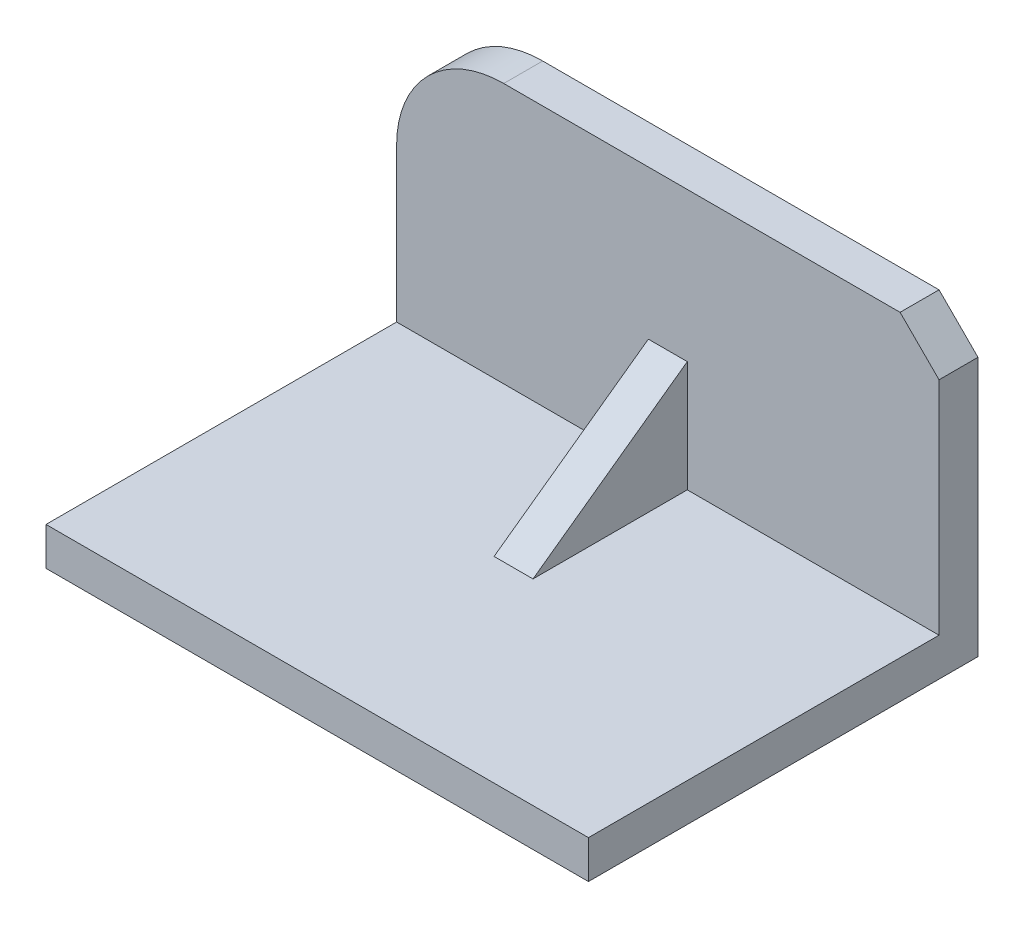
ISO-10303-21;
HEADER;
FILE_DESCRIPTION(('STEP AP214'),'2;1');
FILE_NAME('part.step','',(''),(''),'','','');
FILE_SCHEMA(('AUTOMOTIVE_DESIGN { 1 0 10303 214 1 1 1 1 }'));
ENDSEC;
DATA;
#1=APPLICATION_CONTEXT('core data for automotive mechanical design processes');
#2=APPLICATION_PROTOCOL_DEFINITION('international standard','automotive_design',2000,#1);
#3=PRODUCT_CONTEXT('',#1,'mechanical');
#4=PRODUCT('Part','Part','',(#3));
#5=PRODUCT_RELATED_PRODUCT_CATEGORY('part','',(#4));
#6=PRODUCT_DEFINITION_FORMATION('','',#4);
#7=PRODUCT_DEFINITION_CONTEXT('part definition',#1,'design');
#8=PRODUCT_DEFINITION('design','',#6,#7);
#9=PRODUCT_DEFINITION_SHAPE('','',#8);
#10=(LENGTH_UNIT() NAMED_UNIT(*) SI_UNIT(.MILLI.,.METRE.));
#11=(NAMED_UNIT(*) PLANE_ANGLE_UNIT() SI_UNIT($,.RADIAN.));
#12=(NAMED_UNIT(*) SI_UNIT($,.STERADIAN.) SOLID_ANGLE_UNIT());
#13=UNCERTAINTY_MEASURE_WITH_UNIT(LENGTH_MEASURE(1.E-05),#10,'distance_accuracy_value','');
#14=(GEOMETRIC_REPRESENTATION_CONTEXT(3) GLOBAL_UNCERTAINTY_ASSIGNED_CONTEXT((#13)) GLOBAL_UNIT_ASSIGNED_CONTEXT((#10,
#11,#12)) REPRESENTATION_CONTEXT('',''));
#15=CARTESIAN_POINT('',(0.,0.,0.));
#16=DIRECTION('',(0.,0.,1.));
#17=DIRECTION('',(1.,0.,0.));
#18=AXIS2_PLACEMENT_3D('',#15,#16,#17);
#19=CARTESIAN_POINT('',(69.6254985830583,38.2775252873685,10.));
#20=DIRECTION('',(-1.,0.,0.));
#21=DIRECTION('',(0.,0.,1.));
#22=AXIS2_PLACEMENT_3D('',#19,#20,#21);
#23=PLANE('',#22);
#24=DIRECTION('',(0.,1.,0.));
#25=VECTOR('',#24,1.);
#26=CARTESIAN_POINT('',(69.6254985830583,38.2775252873685,0.));
#27=LINE('',#26,#25);
#28=CARTESIAN_POINT('',(69.6254985830583,-38.2775252873685,0.));
#29=VERTEX_POINT('',#28);
#30=CARTESIAN_POINT('',(69.6254985830583,28.2775252873685,0.));
#31=VERTEX_POINT('',#30);
#32=EDGE_CURVE('E180',#29,#31,#27,.T.);
#33=ORIENTED_EDGE('',*,*,#32,.T.);
#34=DIRECTION('',(0.,0.,1.));
#35=VECTOR('',#34,1.);
#36=CARTESIAN_POINT('',(69.6254985830583,28.2775252873685,10.));
#37=LINE('',#36,#35);
#38=CARTESIAN_POINT('',(69.6254985830583,28.2775252873685,10.));
#39=VERTEX_POINT('',#38);
#40=EDGE_CURVE('E232',#31,#39,#37,.T.);
#41=ORIENTED_EDGE('',*,*,#40,.T.);
#42=DIRECTION('',(0.,1.,0.));
#43=VECTOR('',#42,1.);
#44=CARTESIAN_POINT('',(69.6254985830583,38.2775252873685,10.));
#45=LINE('',#44,#43);
#46=CARTESIAN_POINT('',(69.6254985830583,-28.5062351792943,10.));
#47=VERTEX_POINT('',#46);
#48=EDGE_CURVE('E181',#47,#39,#45,.T.);
#49=ORIENTED_EDGE('',*,*,#48,.F.);
#50=DIRECTION('',(0.,0.,-1.));
#51=VECTOR('',#50,1.);
#52=CARTESIAN_POINT('',(69.6254985830583,-28.5062351792942,100.));
#53=LINE('',#52,#51);
#54=CARTESIAN_POINT('',(69.6254985830583,-28.5062351792942,100.));
#55=VERTEX_POINT('',#54);
#56=EDGE_CURVE('E176',#55,#47,#53,.T.);
#57=ORIENTED_EDGE('',*,*,#56,.F.);
#58=DIRECTION('',(0.,1.,0.));
#59=VECTOR('',#58,1.);
#60=CARTESIAN_POINT('',(69.6254985830583,-38.2775252873685,100.));
#61=LINE('',#60,#59);
#62=CARTESIAN_POINT('',(69.6254985830583,-38.2775252873685,100.));
#63=VERTEX_POINT('',#62);
#64=EDGE_CURVE('E164',#63,#55,#61,.T.);
#65=ORIENTED_EDGE('',*,*,#64,.F.);
#66=DIRECTION('',(0.,0.,-1.));
#67=VECTOR('',#66,1.);
#68=CARTESIAN_POINT('',(69.6254985830583,-38.2775252873685,10.));
#69=LINE('',#68,#67);
#70=EDGE_CURVE('E195',#63,#29,#69,.T.);
#71=ORIENTED_EDGE('',*,*,#70,.T.);
#72=EDGE_LOOP('',(#33,#41,#49,#57,#65,#71));
#73=FACE_BOUND('',#72,.T.);
#74=ADVANCED_FACE('F41',(#73),#23,.F.);
#75=CARTESIAN_POINT('',(-42.118258455678,38.2775252873685,10.));
#76=DIRECTION('',(0.,-1.,0.));
#77=DIRECTION('',(1.,0.,0.));
#78=AXIS2_PLACEMENT_3D('',#75,#76,#77);
#79=PLANE('',#78);
#80=DIRECTION('',(-1.,0.,0.));
#81=VECTOR('',#80,1.);
#82=CARTESIAN_POINT('',(-42.118258455678,38.2775252873685,10.));
#83=LINE('',#82,#81);
#84=CARTESIAN_POINT('',(59.6254985830583,38.2775252873685,10.));
#85=VERTEX_POINT('',#84);
#86=CARTESIAN_POINT('',(-42.118258455678,38.2775252873685,10.));
#87=VERTEX_POINT('',#86);
#88=EDGE_CURVE('E184',#85,#87,#83,.T.);
#89=ORIENTED_EDGE('',*,*,#88,.F.);
#90=DIRECTION('',(0.,0.,-1.));
#91=VECTOR('',#90,1.);
#92=CARTESIAN_POINT('',(59.6254985830583,38.2775252873685,10.));
#93=LINE('',#92,#91);
#94=CARTESIAN_POINT('',(59.6254985830583,38.2775252873685,0.));
#95=VERTEX_POINT('',#94);
#96=EDGE_CURVE('E225',#85,#95,#93,.T.);
#97=ORIENTED_EDGE('',*,*,#96,.T.);
#98=DIRECTION('',(-1.,0.,0.));
#99=VECTOR('',#98,1.);
#100=CARTESIAN_POINT('',(-42.118258455678,38.2775252873685,0.));
#101=LINE('',#100,#99);
#102=CARTESIAN_POINT('',(-42.118258455678,38.2775252873685,0.));
#103=VERTEX_POINT('',#102);
#104=EDGE_CURVE('E199',#95,#103,#101,.T.);
#105=ORIENTED_EDGE('',*,*,#104,.T.);
#106=DIRECTION('',(0.,0.,-1.));
#107=VECTOR('',#106,1.);
#108=CARTESIAN_POINT('',(-42.118258455678,38.2775252873685,10.));
#109=LINE('',#108,#107);
#110=EDGE_CURVE('E221',#87,#103,#109,.T.);
#111=ORIENTED_EDGE('',*,*,#110,.F.);
#112=EDGE_LOOP('',(#89,#97,#105,#111));
#113=FACE_BOUND('',#112,.T.);
#114=ADVANCED_FACE('F246',(#113),#79,.F.);
#115=CARTESIAN_POINT('',(-42.118258455678,10.7702851599883,10.));
#116=DIRECTION('',(0.,0.,-1.));
#117=DIRECTION('',(-1.,0.,0.));
#118=AXIS2_PLACEMENT_3D('',#115,#116,#117);
#119=CYLINDRICAL_SURFACE('',#118,27.5072401273802);
#120=CARTESIAN_POINT('',(-42.118258455678,10.7702851599883,0.));
#121=DIRECTION('',(0.,0.,1.));
#122=DIRECTION('',(1.,0.,0.));
#123=AXIS2_PLACEMENT_3D('',#120,#121,#122);
#124=CIRCLE('',#123,27.5072401273802);
#125=CARTESIAN_POINT('',(-69.6254985830583,10.7702851599883,0.));
#126=VERTEX_POINT('',#125);
#127=EDGE_CURVE('E202',#103,#126,#124,.T.);
#128=ORIENTED_EDGE('',*,*,#127,.T.);
#129=DIRECTION('',(0.,0.,-1.));
#130=VECTOR('',#129,1.);
#131=CARTESIAN_POINT('',(-69.6254985830583,10.7702851599883,10.));
#132=LINE('',#131,#130);
#133=CARTESIAN_POINT('',(-69.6254985830583,10.7702851599883,10.));
#134=VERTEX_POINT('',#133);
#135=EDGE_CURVE('E217',#134,#126,#132,.T.);
#136=ORIENTED_EDGE('',*,*,#135,.F.);
#137=CARTESIAN_POINT('',(-42.118258455678,10.7702851599883,10.));
#138=DIRECTION('',(0.,0.,1.));
#139=DIRECTION('',(1.,0.,0.));
#140=AXIS2_PLACEMENT_3D('',#137,#138,#139);
#141=CIRCLE('',#140,27.5072401273802);
#142=EDGE_CURVE('E188',#87,#134,#141,.T.);
#143=ORIENTED_EDGE('',*,*,#142,.F.);
#144=ORIENTED_EDGE('',*,*,#110,.T.);
#145=EDGE_LOOP('',(#128,#136,#143,#144));
#146=FACE_BOUND('',#145,.T.);
#147=ADVANCED_FACE('F271',(#146),#119,.T.);
#148=CARTESIAN_POINT('',(-69.6254985830583,10.7702851599883,10.));
#149=DIRECTION('',(1.,0.,0.));
#150=DIRECTION('',(0.,1.,0.));
#151=AXIS2_PLACEMENT_3D('',#148,#149,#150);
#152=PLANE('',#151);
#153=DIRECTION('',(0.,-1.,0.));
#154=VECTOR('',#153,1.);
#155=CARTESIAN_POINT('',(-69.6254985830583,10.7702851599883,0.));
#156=LINE('',#155,#154);
#157=CARTESIAN_POINT('',(-69.6254985830583,-38.2775252873685,0.));
#158=VERTEX_POINT('',#157);
#159=EDGE_CURVE('E205',#126,#158,#156,.T.);
#160=ORIENTED_EDGE('',*,*,#159,.T.);
#161=DIRECTION('',(0.,0.,-1.));
#162=VECTOR('',#161,1.);
#163=CARTESIAN_POINT('',(-69.6254985830583,-38.2775252873685,10.));
#164=LINE('',#163,#162);
#165=CARTESIAN_POINT('',(-69.6254985830583,-38.2775252873685,100.));
#166=VERTEX_POINT('',#165);
#167=EDGE_CURVE('E213',#166,#158,#164,.T.);
#168=ORIENTED_EDGE('',*,*,#167,.F.);
#169=DIRECTION('',(0.,-1.,0.));
#170=VECTOR('',#169,1.);
#171=CARTESIAN_POINT('',(-69.6254985830583,-38.2775252873685,100.));
#172=LINE('',#171,#170);
#173=CARTESIAN_POINT('',(-69.6254985830583,-28.5062351792942,100.));
#174=VERTEX_POINT('',#173);
#175=EDGE_CURVE('E155',#174,#166,#172,.T.);
#176=ORIENTED_EDGE('',*,*,#175,.F.);
#177=DIRECTION('',(0.,0.,-1.));
#178=VECTOR('',#177,1.);
#179=CARTESIAN_POINT('',(-69.6254985830583,-28.5062351792942,100.));
#180=LINE('',#179,#178);
#181=CARTESIAN_POINT('',(-69.6254985830583,-28.5062351792942,10.));
#182=VERTEX_POINT('',#181);
#183=EDGE_CURVE('E170',#174,#182,#180,.T.);
#184=ORIENTED_EDGE('',*,*,#183,.T.);
#185=DIRECTION('',(0.,-1.,0.));
#186=VECTOR('',#185,1.);
#187=CARTESIAN_POINT('',(-69.6254985830583,10.7702851599883,10.));
#188=LINE('',#187,#186);
#189=EDGE_CURVE('E191',#134,#182,#188,.T.);
#190=ORIENTED_EDGE('',*,*,#189,.F.);
#191=ORIENTED_EDGE('',*,*,#135,.T.);
#192=EDGE_LOOP('',(#160,#168,#176,#184,#190,#191));
#193=FACE_BOUND('',#192,.T.);
#194=ADVANCED_FACE('F266',(#193),#152,.F.);
#195=CARTESIAN_POINT('',(-69.6254985830583,-38.2775252873685,10.));
#196=DIRECTION('',(0.,1.,0.));
#197=DIRECTION('',(0.,0.,1.));
#198=AXIS2_PLACEMENT_3D('',#195,#196,#197);
#199=PLANE('',#198);
#200=DIRECTION('',(1.,0.,0.));
#201=VECTOR('',#200,1.);
#202=CARTESIAN_POINT('',(-69.6254985830583,-38.2775252873685,0.));
#203=LINE('',#202,#201);
#204=EDGE_CURVE('E185',#158,#29,#203,.T.);
#205=ORIENTED_EDGE('',*,*,#204,.T.);
#206=ORIENTED_EDGE('',*,*,#70,.F.);
#207=DIRECTION('',(1.,0.,0.));
#208=VECTOR('',#207,1.);
#209=CARTESIAN_POINT('',(-69.6254985830583,-38.2775252873685,100.));
#210=LINE('',#209,#208);
#211=EDGE_CURVE('E159',#166,#63,#210,.T.);
#212=ORIENTED_EDGE('',*,*,#211,.F.);
#213=ORIENTED_EDGE('',*,*,#167,.T.);
#214=EDGE_LOOP('',(#205,#206,#212,#213));
#215=FACE_BOUND('',#214,.T.);
#216=ADVANCED_FACE('F259',(#215),#199,.F.);
#217=CARTESIAN_POINT('',(-42.118258455678,10.7702851599883,10.));
#218=DIRECTION('',(0.,0.,1.));
#219=DIRECTION('',(1.,0.,0.));
#220=AXIS2_PLACEMENT_3D('',#217,#218,#219);
#221=PLANE('',#220);
#222=DIRECTION('',(0.,1.,0.));
#223=VECTOR('',#222,1.);
#224=CARTESIAN_POINT('',(5.,10.7702851599883,10.));
#225=LINE('',#224,#223);
#226=CARTESIAN_POINT('',(5.,-28.5062351792942,10.));
#227=VERTEX_POINT('',#226);
#228=CARTESIAN_POINT('',(5.,0.,10.));
#229=VERTEX_POINT('',#228);
#230=EDGE_CURVE('E149',#227,#229,#225,.T.);
#231=ORIENTED_EDGE('',*,*,#230,.F.);
#232=DIRECTION('',(-1.,0.,0.));
#233=VECTOR('',#232,1.);
#234=CARTESIAN_POINT('',(-69.6254985830583,-28.5062351792942,10.));
#235=LINE('',#234,#233);
#236=EDGE_CURVE('E160',#47,#227,#235,.T.);
#237=ORIENTED_EDGE('',*,*,#236,.F.);
#238=ORIENTED_EDGE('',*,*,#48,.T.);
#239=DIRECTION('',(0.707106781186546,-0.707106781186549,0.));
#240=VECTOR('',#239,1.);
#241=CARTESIAN_POINT('',(22.5072401273805,75.3957837430465,10.));
#242=LINE('',#241,#240);
#243=EDGE_CURVE('E138',#39,#85,#242,.F.);
#244=ORIENTED_EDGE('',*,*,#243,.T.);
#245=ORIENTED_EDGE('',*,*,#88,.T.);
#246=ORIENTED_EDGE('',*,*,#142,.T.);
#247=ORIENTED_EDGE('',*,*,#189,.T.);
#248=CARTESIAN_POINT('',(-5.,-28.5062351792942,10.));
#249=VERTEX_POINT('',#248);
#250=EDGE_CURVE('E154',#249,#182,#235,.T.);
#251=ORIENTED_EDGE('',*,*,#250,.F.);
#252=DIRECTION('',(0.,1.,0.));
#253=VECTOR('',#252,1.);
#254=CARTESIAN_POINT('',(-5.,10.7702851599883,10.));
#255=LINE('',#254,#253);
#256=CARTESIAN_POINT('',(-5.,0.,10.));
#257=VERTEX_POINT('',#256);
#258=EDGE_CURVE('E63',#249,#257,#255,.T.);
#259=ORIENTED_EDGE('',*,*,#258,.T.);
#260=DIRECTION('',(1.,0.,0.));
#261=VECTOR('',#260,1.);
#262=CARTESIAN_POINT('',(-42.118258455678,0.,10.));
#263=LINE('',#262,#261);
#264=EDGE_CURVE('E58',#229,#257,#263,.F.);
#265=ORIENTED_EDGE('',*,*,#264,.F.);
#266=EDGE_LOOP('',(#231,#237,#238,#244,#245,#246,#247,#251,#259,#265));
#267=FACE_BOUND('',#266,.T.);
#268=ADVANCED_FACE('F239',(#267),#221,.T.);
#269=CARTESIAN_POINT('',(-42.118258455678,10.7702851599883,0.));
#270=DIRECTION('',(0.,0.,1.));
#271=DIRECTION('',(1.,0.,0.));
#272=AXIS2_PLACEMENT_3D('',#269,#270,#271);
#273=PLANE('',#272);
#274=ORIENTED_EDGE('',*,*,#32,.F.);
#275=ORIENTED_EDGE('',*,*,#204,.F.);
#276=ORIENTED_EDGE('',*,*,#159,.F.);
#277=ORIENTED_EDGE('',*,*,#127,.F.);
#278=ORIENTED_EDGE('',*,*,#104,.F.);
#279=DIRECTION('',(-0.707106781186546,0.707106781186549,0.));
#280=VECTOR('',#279,1.);
#281=CARTESIAN_POINT('',(59.6254985830583,38.2775252873685,0.));
#282=LINE('',#281,#280);
#283=EDGE_CURVE('E229',#95,#31,#282,.F.);
#284=ORIENTED_EDGE('',*,*,#283,.T.);
#285=EDGE_LOOP('',(#274,#275,#276,#277,#278,#284));
#286=FACE_BOUND('',#285,.T.);
#287=ADVANCED_FACE('F251',(#286),#273,.F.);
#288=CARTESIAN_POINT('',(59.6254985830583,38.2775252873685,10.));
#289=DIRECTION('',(-0.707106781186549,-0.707106781186546,0.));
#290=DIRECTION('',(0.,0.,-1.));
#291=AXIS2_PLACEMENT_3D('',#288,#289,#290);
#292=PLANE('',#291);
#293=ORIENTED_EDGE('',*,*,#243,.F.);
#294=ORIENTED_EDGE('',*,*,#40,.F.);
#295=ORIENTED_EDGE('',*,*,#283,.F.);
#296=ORIENTED_EDGE('',*,*,#96,.F.);
#297=EDGE_LOOP('',(#293,#294,#295,#296));
#298=FACE_BOUND('',#297,.T.);
#299=ADVANCED_FACE('F44',(#298),#292,.F.);
#300=CARTESIAN_POINT('',(-69.6254985830583,-28.5062351792942,100.));
#301=DIRECTION('',(0.,-1.,0.));
#302=DIRECTION('',(0.,0.,-1.));
#303=AXIS2_PLACEMENT_3D('',#300,#301,#302);
#304=PLANE('',#303);
#305=ORIENTED_EDGE('',*,*,#236,.T.);
#306=DIRECTION('',(0.,0.,1.));
#307=VECTOR('',#306,1.);
#308=CARTESIAN_POINT('',(5.,-28.5062351792942,100.));
#309=LINE('',#308,#307);
#310=CARTESIAN_POINT('',(5.,-28.5062351792942,49.6063246644352));
#311=VERTEX_POINT('',#310);
#312=EDGE_CURVE('E11',#227,#311,#309,.T.);
#313=ORIENTED_EDGE('',*,*,#312,.T.);
#314=DIRECTION('',(1.,0.,0.));
#315=VECTOR('',#314,1.);
#316=CARTESIAN_POINT('',(-69.6254985830583,-28.5062351792942,49.6063246644352));
#317=LINE('',#316,#315);
#318=CARTESIAN_POINT('',(-5.,-28.5062351792943,49.6063246644352));
#319=VERTEX_POINT('',#318);
#320=EDGE_CURVE('E51',#311,#319,#317,.F.);
#321=ORIENTED_EDGE('',*,*,#320,.T.);
#322=DIRECTION('',(0.,0.,1.));
#323=VECTOR('',#322,1.);
#324=CARTESIAN_POINT('',(-5.,-28.5062351792942,100.));
#325=LINE('',#324,#323);
#326=EDGE_CURVE('E126',#249,#319,#325,.T.);
#327=ORIENTED_EDGE('',*,*,#326,.F.);
#328=ORIENTED_EDGE('',*,*,#250,.T.);
#329=ORIENTED_EDGE('',*,*,#183,.F.);
#330=DIRECTION('',(-1.,0.,0.));
#331=VECTOR('',#330,1.);
#332=CARTESIAN_POINT('',(-69.6254985830583,-28.5062351792942,100.));
#333=LINE('',#332,#331);
#334=EDGE_CURVE('E167',#55,#174,#333,.T.);
#335=ORIENTED_EDGE('',*,*,#334,.F.);
#336=ORIENTED_EDGE('',*,*,#56,.T.);
#337=EDGE_LOOP('',(#305,#313,#321,#327,#328,#329,#335,#336));
#338=FACE_BOUND('',#337,.T.);
#339=ADVANCED_FACE('F125',(#338),#304,.F.);
#340=CARTESIAN_POINT('',(0.,0.,100.));
#341=DIRECTION('',(0.,0.,-1.));
#342=DIRECTION('',(-1.,0.,0.));
#343=AXIS2_PLACEMENT_3D('',#340,#341,#342);
#344=PLANE('',#343);
#345=ORIENTED_EDGE('',*,*,#175,.T.);
#346=ORIENTED_EDGE('',*,*,#211,.T.);
#347=ORIENTED_EDGE('',*,*,#64,.T.);
#348=ORIENTED_EDGE('',*,*,#334,.T.);
#349=EDGE_LOOP('',(#345,#346,#347,#348));
#350=FACE_BOUND('',#349,.T.);
#351=ADVANCED_FACE('F261',(#350),#344,.F.);
#352=CARTESIAN_POINT('',(0.,-28.5062351792943,49.6063246644352));
#353=DIRECTION('',(0.,-0.811634597469238,-0.584165456177398));
#354=DIRECTION('',(0.,0.584165456177398,-0.811634597469238));
#355=AXIS2_PLACEMENT_3D('',#352,#353,#354);
#356=PLANE('',#355);
#357=DIRECTION('',(0.,0.584165456177398,-0.811634597469238));
#358=VECTOR('',#357,1.);
#359=CARTESIAN_POINT('',(5.,-28.5062351792943,49.6063246644352));
#360=LINE('',#359,#358);
#361=EDGE_CURVE('E142',#311,#229,#360,.T.);
#362=ORIENTED_EDGE('',*,*,#361,.T.);
#363=ORIENTED_EDGE('',*,*,#264,.T.);
#364=DIRECTION('',(0.,0.584165456177398,-0.811634597469238));
#365=VECTOR('',#364,1.);
#366=CARTESIAN_POINT('',(-5.,-28.5062351792943,49.6063246644352));
#367=LINE('',#366,#365);
#368=EDGE_CURVE('E136',#319,#257,#367,.T.);
#369=ORIENTED_EDGE('',*,*,#368,.F.);
#370=ORIENTED_EDGE('',*,*,#320,.F.);
#371=EDGE_LOOP('',(#362,#363,#369,#370));
#372=FACE_BOUND('',#371,.T.);
#373=ADVANCED_FACE('F140',(#372),#356,.F.);
#374=CARTESIAN_POINT('',(5.,0.,50.));
#375=DIRECTION('',(1.,0.,0.));
#376=DIRECTION('',(0.,0.,-1.));
#377=AXIS2_PLACEMENT_3D('',#374,#375,#376);
#378=PLANE('',#377);
#379=ORIENTED_EDGE('',*,*,#312,.F.);
#380=ORIENTED_EDGE('',*,*,#230,.T.);
#381=ORIENTED_EDGE('',*,*,#361,.F.);
#382=EDGE_LOOP('',(#379,#380,#381));
#383=FACE_BOUND('',#382,.T.);
#384=ADVANCED_FACE('F274',(#383),#378,.T.);
#385=CARTESIAN_POINT('',(-5.,0.,50.));
#386=DIRECTION('',(1.,0.,0.));
#387=DIRECTION('',(0.,0.,-1.));
#388=AXIS2_PLACEMENT_3D('',#385,#386,#387);
#389=PLANE('',#388);
#390=ORIENTED_EDGE('',*,*,#258,.F.);
#391=ORIENTED_EDGE('',*,*,#326,.T.);
#392=ORIENTED_EDGE('',*,*,#368,.T.);
#393=EDGE_LOOP('',(#390,#391,#392));
#394=FACE_BOUND('',#393,.T.);
#395=ADVANCED_FACE('F135',(#394),#389,.F.);
#396=CLOSED_SHELL('',(#74,#114,#147,#194,#216,#268,#287,#299,#339,#351,#373,#384,#395));
#397=MANIFOLD_SOLID_BREP('B2',#396);
#398=ADVANCED_BREP_SHAPE_REPRESENTATION('',(#18,#397),#14);
#399=SHAPE_DEFINITION_REPRESENTATION(#9,#398);
ENDSEC;
END-ISO-10303-21;
